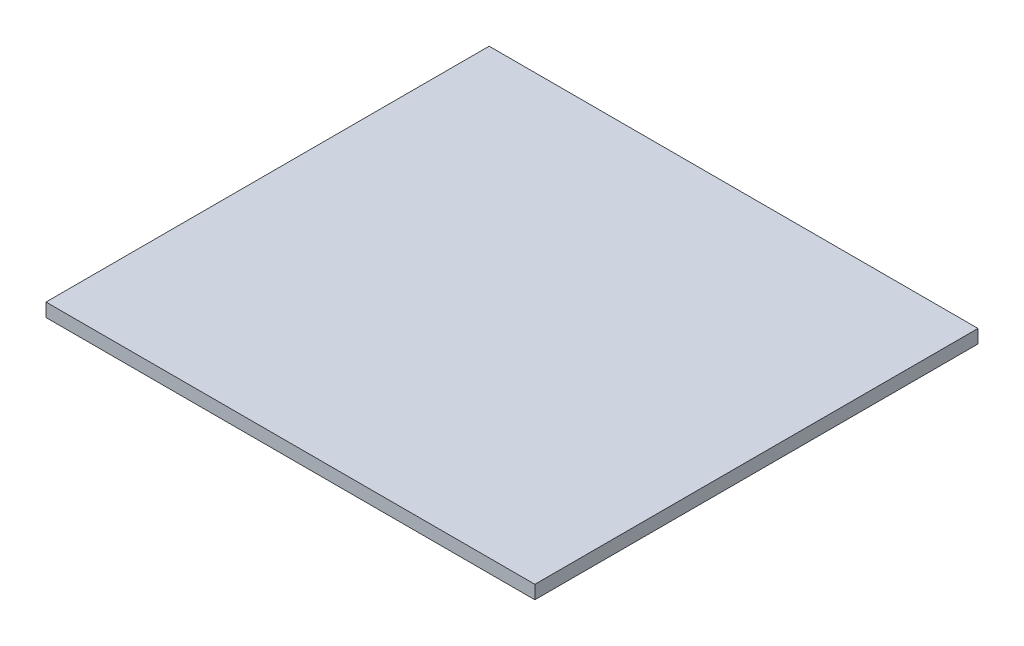
ISO-10303-21;
HEADER;
FILE_DESCRIPTION(('STEP AP214'),'2;1');
FILE_NAME('part.step','',(''),(''),'','','');
FILE_SCHEMA(('AUTOMOTIVE_DESIGN { 1 0 10303 214 1 1 1 1 }'));
ENDSEC;
DATA;
#1=APPLICATION_CONTEXT('core data for automotive mechanical design processes');
#2=APPLICATION_PROTOCOL_DEFINITION('international standard','automotive_design',2000,#1);
#3=PRODUCT_CONTEXT('',#1,'mechanical');
#4=PRODUCT('Part','Part','',(#3));
#5=PRODUCT_RELATED_PRODUCT_CATEGORY('part','',(#4));
#6=PRODUCT_DEFINITION_FORMATION('','',#4);
#7=PRODUCT_DEFINITION_CONTEXT('part definition',#1,'design');
#8=PRODUCT_DEFINITION('design','',#6,#7);
#9=PRODUCT_DEFINITION_SHAPE('','',#8);
#10=(LENGTH_UNIT() NAMED_UNIT(*) SI_UNIT(.MILLI.,.METRE.));
#11=(NAMED_UNIT(*) PLANE_ANGLE_UNIT() SI_UNIT($,.RADIAN.));
#12=(NAMED_UNIT(*) SI_UNIT($,.STERADIAN.) SOLID_ANGLE_UNIT());
#13=UNCERTAINTY_MEASURE_WITH_UNIT(LENGTH_MEASURE(1.E-05),#10,'distance_accuracy_value','');
#14=(GEOMETRIC_REPRESENTATION_CONTEXT(3) GLOBAL_UNCERTAINTY_ASSIGNED_CONTEXT((#13)) GLOBAL_UNIT_ASSIGNED_CONTEXT((#10,
#11,#12)) REPRESENTATION_CONTEXT('',''));
#15=CARTESIAN_POINT('',(0.,0.,0.));
#16=DIRECTION('',(0.,0.,1.));
#17=DIRECTION('',(1.,0.,0.));
#18=AXIS2_PLACEMENT_3D('',#15,#16,#17);
#19=CARTESIAN_POINT('',(-44.2815420560747,3.,-20.6980140186916));
#20=DIRECTION('',(1.,0.,0.));
#21=DIRECTION('',(0.,0.,-1.));
#22=AXIS2_PLACEMENT_3D('',#19,#20,#21);
#23=PLANE('',#22);
#24=DIRECTION('',(0.,0.,1.));
#25=VECTOR('',#24,1.);
#26=CARTESIAN_POINT('',(-44.2815420560747,0.,-20.6980140186916));
#27=LINE('',#26,#25);
#28=CARTESIAN_POINT('',(-44.2815420560747,0.,-20.6980140186916));
#29=VERTEX_POINT('',#28);
#30=CARTESIAN_POINT('',(-44.2815420560747,0.,78.1019859813084));
#31=VERTEX_POINT('',#30);
#32=EDGE_CURVE('E117',#29,#31,#27,.T.);
#33=ORIENTED_EDGE('',*,*,#32,.T.);
#34=DIRECTION('',(0.,-1.,0.));
#35=VECTOR('',#34,1.);
#36=CARTESIAN_POINT('',(-44.2815420560747,3.,78.1019859813084));
#37=LINE('',#36,#35);
#38=CARTESIAN_POINT('',(-44.2815420560747,3.,78.1019859813084));
#39=VERTEX_POINT('',#38);
#40=EDGE_CURVE('E12',#39,#31,#37,.T.);
#41=ORIENTED_EDGE('',*,*,#40,.F.);
#42=DIRECTION('',(0.,0.,1.));
#43=VECTOR('',#42,1.);
#44=CARTESIAN_POINT('',(-44.2815420560747,3.,-20.6980140186916));
#45=LINE('',#44,#43);
#46=CARTESIAN_POINT('',(-44.2815420560747,3.,-20.6980140186916));
#47=VERTEX_POINT('',#46);
#48=EDGE_CURVE('E86',#47,#39,#45,.T.);
#49=ORIENTED_EDGE('',*,*,#48,.F.);
#50=DIRECTION('',(0.,-1.,0.));
#51=VECTOR('',#50,1.);
#52=CARTESIAN_POINT('',(-44.2815420560747,3.,-20.6980140186916));
#53=LINE('',#52,#51);
#54=EDGE_CURVE('E97',#47,#29,#53,.T.);
#55=ORIENTED_EDGE('',*,*,#54,.T.);
#56=EDGE_LOOP('',(#33,#41,#49,#55));
#57=FACE_BOUND('',#56,.T.);
#58=ADVANCED_FACE('F35',(#57),#23,.F.);
#59=CARTESIAN_POINT('',(-44.2815420560747,3.,78.1019859813084));
#60=DIRECTION('',(0.,0.,-1.));
#61=DIRECTION('',(-1.,0.,0.));
#62=AXIS2_PLACEMENT_3D('',#59,#60,#61);
#63=PLANE('',#62);
#64=DIRECTION('',(1.,0.,0.));
#65=VECTOR('',#64,1.);
#66=CARTESIAN_POINT('',(-44.2815420560747,0.,78.1019859813084));
#67=LINE('',#66,#65);
#68=CARTESIAN_POINT('',(64.7184579439253,0.,78.1019859813084));
#69=VERTEX_POINT('',#68);
#70=EDGE_CURVE('E91',#31,#69,#67,.T.);
#71=ORIENTED_EDGE('',*,*,#70,.T.);
#72=DIRECTION('',(0.,-1.,0.));
#73=VECTOR('',#72,1.);
#74=CARTESIAN_POINT('',(64.7184579439253,3.,78.1019859813084));
#75=LINE('',#74,#73);
#76=CARTESIAN_POINT('',(64.7184579439253,3.,78.1019859813084));
#77=VERTEX_POINT('',#76);
#78=EDGE_CURVE('E43',#77,#69,#75,.T.);
#79=ORIENTED_EDGE('',*,*,#78,.F.);
#80=DIRECTION('',(1.,0.,0.));
#81=VECTOR('',#80,1.);
#82=CARTESIAN_POINT('',(-44.2815420560747,3.,78.1019859813084));
#83=LINE('',#82,#81);
#84=EDGE_CURVE('E81',#39,#77,#83,.T.);
#85=ORIENTED_EDGE('',*,*,#84,.F.);
#86=ORIENTED_EDGE('',*,*,#40,.T.);
#87=EDGE_LOOP('',(#71,#79,#85,#86));
#88=FACE_BOUND('',#87,.T.);
#89=ADVANCED_FACE('F90',(#88),#63,.F.);
#90=CARTESIAN_POINT('',(64.7184579439252,3.,-20.6980140186916));
#91=DIRECTION('',(-1.,0.,0.));
#92=DIRECTION('',(0.,0.,1.));
#93=AXIS2_PLACEMENT_3D('',#90,#91,#92);
#94=PLANE('',#93);
#95=DIRECTION('',(0.,0.,-1.));
#96=VECTOR('',#95,1.);
#97=CARTESIAN_POINT('',(64.7184579439252,0.,-20.6980140186916));
#98=LINE('',#97,#96);
#99=CARTESIAN_POINT('',(64.7184579439252,0.,-20.6980140186916));
#100=VERTEX_POINT('',#99);
#101=EDGE_CURVE('E68',#69,#100,#98,.T.);
#102=ORIENTED_EDGE('',*,*,#101,.T.);
#103=DIRECTION('',(0.,-1.,0.));
#104=VECTOR('',#103,1.);
#105=CARTESIAN_POINT('',(64.7184579439252,3.,-20.6980140186916));
#106=LINE('',#105,#104);
#107=CARTESIAN_POINT('',(64.7184579439252,3.,-20.6980140186916));
#108=VERTEX_POINT('',#107);
#109=EDGE_CURVE('E92',#108,#100,#106,.T.);
#110=ORIENTED_EDGE('',*,*,#109,.F.);
#111=DIRECTION('',(0.,0.,-1.));
#112=VECTOR('',#111,1.);
#113=CARTESIAN_POINT('',(64.7184579439252,3.,-20.6980140186916));
#114=LINE('',#113,#112);
#115=EDGE_CURVE('E84',#77,#108,#114,.T.);
#116=ORIENTED_EDGE('',*,*,#115,.F.);
#117=ORIENTED_EDGE('',*,*,#78,.T.);
#118=EDGE_LOOP('',(#102,#110,#116,#117));
#119=FACE_BOUND('',#118,.T.);
#120=ADVANCED_FACE('F93',(#119),#94,.F.);
#121=CARTESIAN_POINT('',(-44.2815420560747,3.,-20.6980140186916));
#122=DIRECTION('',(0.,0.,1.));
#123=DIRECTION('',(1.,0.,0.));
#124=AXIS2_PLACEMENT_3D('',#121,#122,#123);
#125=PLANE('',#124);
#126=DIRECTION('',(-1.,0.,0.));
#127=VECTOR('',#126,1.);
#128=CARTESIAN_POINT('',(-44.2815420560747,0.,-20.6980140186916));
#129=LINE('',#128,#127);
#130=EDGE_CURVE('E74',#100,#29,#129,.T.);
#131=ORIENTED_EDGE('',*,*,#130,.T.);
#132=ORIENTED_EDGE('',*,*,#54,.F.);
#133=DIRECTION('',(-1.,0.,0.));
#134=VECTOR('',#133,1.);
#135=CARTESIAN_POINT('',(-44.2815420560747,3.,-20.6980140186916));
#136=LINE('',#135,#134);
#137=EDGE_CURVE('E51',#108,#47,#136,.T.);
#138=ORIENTED_EDGE('',*,*,#137,.F.);
#139=ORIENTED_EDGE('',*,*,#109,.T.);
#140=EDGE_LOOP('',(#131,#132,#138,#139));
#141=FACE_BOUND('',#140,.T.);
#142=ADVANCED_FACE('F112',(#141),#125,.F.);
#143=CARTESIAN_POINT('',(0.,3.,0.));
#144=DIRECTION('',(0.,1.,0.));
#145=DIRECTION('',(0.,0.,1.));
#146=AXIS2_PLACEMENT_3D('',#143,#144,#145);
#147=PLANE('',#146);
#148=ORIENTED_EDGE('',*,*,#48,.T.);
#149=ORIENTED_EDGE('',*,*,#84,.T.);
#150=ORIENTED_EDGE('',*,*,#115,.T.);
#151=ORIENTED_EDGE('',*,*,#137,.T.);
#152=EDGE_LOOP('',(#148,#149,#150,#151));
#153=FACE_BOUND('',#152,.T.);
#154=ADVANCED_FACE('F82',(#153),#147,.T.);
#155=CARTESIAN_POINT('',(0.,0.,0.));
#156=DIRECTION('',(0.,1.,0.));
#157=DIRECTION('',(0.,0.,1.));
#158=AXIS2_PLACEMENT_3D('',#155,#156,#157);
#159=PLANE('',#158);
#160=ORIENTED_EDGE('',*,*,#32,.F.);
#161=ORIENTED_EDGE('',*,*,#130,.F.);
#162=ORIENTED_EDGE('',*,*,#101,.F.);
#163=ORIENTED_EDGE('',*,*,#70,.F.);
#164=EDGE_LOOP('',(#160,#161,#162,#163));
#165=FACE_BOUND('',#164,.T.);
#166=ADVANCED_FACE('F115',(#165),#159,.F.);
#167=CLOSED_SHELL('',(#58,#89,#120,#142,#154,#166));
#168=MANIFOLD_SOLID_BREP('B2',#167);
#169=ADVANCED_BREP_SHAPE_REPRESENTATION('',(#18,#168),#14);
#170=SHAPE_DEFINITION_REPRESENTATION(#9,#169);
ENDSEC;
END-ISO-10303-21;
